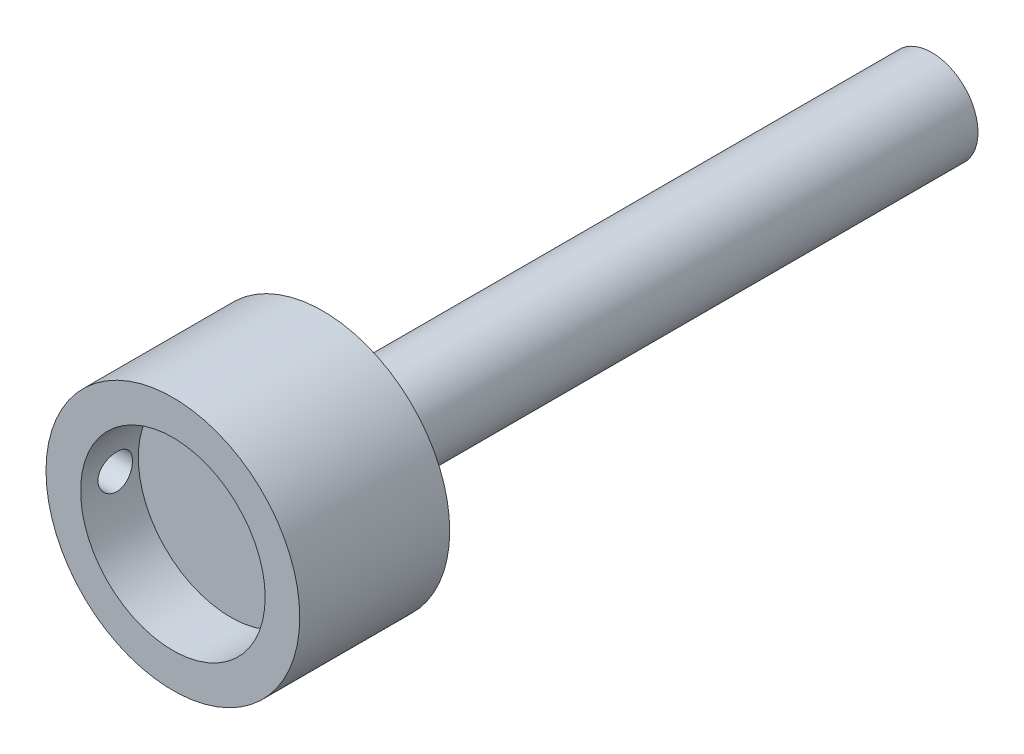
ISO-10303-21;
HEADER;
FILE_DESCRIPTION(('STEP AP214'),'2;1');
FILE_NAME('part.step','',(''),(''),'','','');
FILE_SCHEMA(('AUTOMOTIVE_DESIGN { 1 0 10303 214 1 1 1 1 }'));
ENDSEC;
DATA;
#1=APPLICATION_CONTEXT('core data for automotive mechanical design processes');
#2=APPLICATION_PROTOCOL_DEFINITION('international standard','automotive_design',2000,#1);
#3=PRODUCT_CONTEXT('',#1,'mechanical');
#4=PRODUCT('Part','Part','',(#3));
#5=PRODUCT_RELATED_PRODUCT_CATEGORY('part','',(#4));
#6=PRODUCT_DEFINITION_FORMATION('','',#4);
#7=PRODUCT_DEFINITION_CONTEXT('part definition',#1,'design');
#8=PRODUCT_DEFINITION('design','',#6,#7);
#9=PRODUCT_DEFINITION_SHAPE('','',#8);
#10=(LENGTH_UNIT() NAMED_UNIT(*) SI_UNIT(.MILLI.,.METRE.));
#11=(NAMED_UNIT(*) PLANE_ANGLE_UNIT() SI_UNIT($,.RADIAN.));
#12=(NAMED_UNIT(*) SI_UNIT($,.STERADIAN.) SOLID_ANGLE_UNIT());
#13=UNCERTAINTY_MEASURE_WITH_UNIT(LENGTH_MEASURE(1.E-05),#10,'distance_accuracy_value','');
#14=(GEOMETRIC_REPRESENTATION_CONTEXT(3) GLOBAL_UNCERTAINTY_ASSIGNED_CONTEXT((#13)) GLOBAL_UNIT_ASSIGNED_CONTEXT((#10,
#11,#12)) REPRESENTATION_CONTEXT('',''));
#15=CARTESIAN_POINT('',(0.,0.,0.));
#16=DIRECTION('',(0.,0.,1.));
#17=DIRECTION('',(1.,0.,0.));
#18=AXIS2_PLACEMENT_3D('',#15,#16,#17);
#19=CARTESIAN_POINT('',(0.,0.,13.));
#20=DIRECTION('',(0.,0.,-1.));
#21=DIRECTION('',(-1.,0.,0.));
#22=AXIS2_PLACEMENT_3D('',#19,#20,#21);
#23=CYLINDRICAL_SURFACE('',#22,11.);
#24=CARTESIAN_POINT('',(-11.,0.,11.5));
#25=CARTESIAN_POINT('',(-10.9999987467262,-0.0838384134298608,11.4999964805426));
#26=CARTESIAN_POINT('',(-10.9990314271488,-0.167727602289746,11.4929474073274));
#27=CARTESIAN_POINT('',(-10.9952656640845,-0.333167097641412,11.4649411167757));
#28=CARTESIAN_POINT('',(-10.992465364401,-0.414714945659857,11.4439698005502));
#29=CARTESIAN_POINT('',(-10.9853487739829,-0.573053093693594,11.3887522661594));
#30=CARTESIAN_POINT('',(-10.9810335583919,-0.649846722453227,11.3545154607979));
#31=CARTESIAN_POINT('',(-10.971365727223,-0.79658530244973,11.2737604754398));
#32=CARTESIAN_POINT('',(-10.9660132749006,-0.86653132885872,11.2272442277457));
#33=CARTESIAN_POINT('',(-10.9548285996925,-0.998057563812247,11.1229277857077));
#34=CARTESIAN_POINT('',(-10.9489937690522,-1.05958678462377,11.0650635769965));
#35=CARTESIAN_POINT('',(-10.9375227155932,-1.17209333908044,10.9398313892076));
#36=CARTESIAN_POINT('',(-10.9318865034525,-1.22307010612799,10.8724629001387));
#37=CARTESIAN_POINT('',(-10.9214253777188,-1.31321850524923,10.7297980617759));
#38=CARTESIAN_POINT('',(-10.916603830108,-1.35234166468404,10.6544708149948));
#39=CARTESIAN_POINT('',(-10.9083529406776,-1.41736264485278,10.4982381846263));
#40=CARTESIAN_POINT('',(-10.904923536173,-1.44326106107985,10.4173330523902));
#41=CARTESIAN_POINT('',(-10.8998704969217,-1.4809409055509,10.2527737564264));
#42=CARTESIAN_POINT('',(-10.8982357822449,-1.49280898864549,10.1691397807089));
#43=CARTESIAN_POINT('',(-10.8969234380482,-1.50235955059667,10.0010525269759));
#44=CARTESIAN_POINT('',(-10.8972457153308,-1.50004270497976,9.91659928816724));
#45=CARTESIAN_POINT('',(-10.8998008033656,-1.4813601701924,9.7498782743991));
#46=CARTESIAN_POINT('',(-10.9020205710196,-1.4650903891759,9.66759952363283));
#47=CARTESIAN_POINT('',(-10.9081001740818,-1.419113676953,9.50695095946735));
#48=CARTESIAN_POINT('',(-10.911960048455,-1.38940642650253,9.42858123898703));
#49=CARTESIAN_POINT('',(-10.920899582937,-1.31729641760208,9.27768007396237));
#50=CARTESIAN_POINT('',(-10.9259831927575,-1.27485243857761,9.20516857073198));
#51=CARTESIAN_POINT('',(-10.9367944433469,-1.1785032304482,9.06826085111422));
#52=CARTESIAN_POINT('',(-10.9425221191218,-1.12459737823042,9.00386507623326));
#53=CARTESIAN_POINT('',(-10.954033973898,-1.006325277838,8.88446044550542));
#54=CARTESIAN_POINT('',(-10.9598182294108,-0.941876450734229,8.82953335968757));
#55=CARTESIAN_POINT('',(-10.9707474705779,-0.80463094440541,8.73126350840162));
#56=CARTESIAN_POINT('',(-10.9758924542398,-0.73183423916464,8.68792077903695));
#57=CARTESIAN_POINT('',(-10.9849675408771,-0.57989296948045,8.61404813681996));
#58=CARTESIAN_POINT('',(-10.9888971094847,-0.500745632131289,8.58352385760728));
#59=CARTESIAN_POINT('',(-10.9950939520307,-0.338383087939894,8.5362221620544));
#60=CARTESIAN_POINT('',(-10.997361318692,-0.25516810828013,8.51944397890651));
#61=CARTESIAN_POINT('',(-10.9999661380375,-0.0877389073676727,8.50021791543442));
#62=CARTESIAN_POINT('',(-11.0003187469014,-0.0035378363878437,8.49765749141139));
#63=CARTESIAN_POINT('',(-10.9990953877098,0.164092294089254,8.50664187833073));
#64=CARTESIAN_POINT('',(-10.9975194687383,0.247521373180418,8.51818633028291));
#65=CARTESIAN_POINT('',(-10.9926255265792,0.410903378364946,8.55495922320966));
#66=CARTESIAN_POINT('',(-10.9893144012332,0.490868720620559,8.58013349557132));
#67=CARTESIAN_POINT('',(-10.9813204406364,0.645443141095587,8.64339475903291));
#68=CARTESIAN_POINT('',(-10.9766375509031,0.720052006425216,8.68148226301717));
#69=CARTESIAN_POINT('',(-10.9663836303603,0.86229489298246,8.76975753872403));
#70=CARTESIAN_POINT('',(-10.960807370571,0.929883728353245,8.82001750280037));
#71=CARTESIAN_POINT('',(-10.9494055314268,1.05570701325461,8.93110957795735));
#72=CARTESIAN_POINT('',(-10.9435799402192,1.11394101745332,8.99194219205667));
#73=CARTESIAN_POINT('',(-10.9322886877303,1.21980532954113,9.12295083300841));
#74=CARTESIAN_POINT('',(-10.9268257501214,1.26736066380642,9.19318771348107));
#75=CARTESIAN_POINT('',(-10.9169246504416,1.34999839549265,9.34071830769977));
#76=CARTESIAN_POINT('',(-10.9124864646235,1.38508108196142,9.41801185785858));
#77=CARTESIAN_POINT('',(-10.9051564726067,1.44165849505153,9.57722775667319));
#78=CARTESIAN_POINT('',(-10.902259998972,1.46319427050013,9.65913529443613));
#79=CARTESIAN_POINT('',(-10.8983284316023,1.49219810547519,9.82544652182803));
#80=CARTESIAN_POINT('',(-10.8972932333409,1.49966695497901,9.90985007101435));
#81=CARTESIAN_POINT('',(-10.8972048541528,1.50030856584718,10.078010975391));
#82=CARTESIAN_POINT('',(-10.8981353386205,1.49359914690637,10.1617678966084));
#83=CARTESIAN_POINT('',(-10.9018382005365,1.46632546438534,10.3269511386985));
#84=CARTESIAN_POINT('',(-10.9046105769335,1.44576120871189,10.4083774609012));
#85=CARTESIAN_POINT('',(-10.9116795081979,1.3914005645048,10.5665651393851));
#86=CARTESIAN_POINT('',(-10.9159752803929,1.35761096980691,10.6433288674825));
#87=CARTESIAN_POINT('',(-10.925608111245,1.2777703983912,10.7901162986064));
#88=CARTESIAN_POINT('',(-10.9309451926623,1.23171915365824,10.8601398542606));
#89=CARTESIAN_POINT('',(-10.9421122992185,1.12822915223083,10.9920600365998));
#90=CARTESIAN_POINT('',(-10.9479459056036,1.07070278423403,11.0538876362225));
#91=CARTESIAN_POINT('',(-10.9594178730356,0.946079868053623,11.1670553467108));
#92=CARTESIAN_POINT('',(-10.9650561880416,0.87898108195785,11.2183929983114));
#93=CARTESIAN_POINT('',(-10.9755309296992,0.736765493201999,11.3093259673834));
#94=CARTESIAN_POINT('',(-10.9803636164562,0.661613818517364,11.3488671582763));
#95=CARTESIAN_POINT('',(-10.9886453705716,0.505709693930316,11.414709481053));
#96=CARTESIAN_POINT('',(-10.9920959102772,0.424963312021878,11.4410247096937));
#97=CARTESIAN_POINT('',(-10.9964117606731,0.286518597087191,11.4735104370639));
#98=CARTESIAN_POINT('',(-10.9977506427886,0.229685788696074,11.4834293607973));
#99=CARTESIAN_POINT('',(-10.9995451890738,0.115243313646888,11.4966753209812));
#100=CARTESIAN_POINT('',(-11.0000008615472,0.0576336542977008,11.5000024194064));
#101=CARTESIAN_POINT('',(-11.,0.,11.5));
#102=B_SPLINE_CURVE_WITH_KNOTS('',3,(#24,#25,#26,#27,#28,#29,#30,#31,#32,#33,#34,#35,#36,#37,
#38,#39,#40,#41,#42,#43,#44,#45,#46,#47,#48,#49,#50,#51,#52,#53,#54,#55,#56,#57,#58,#59,#60,#61,
#62,#63,#64,#65,#66,#67,#68,#69,#70,#71,#72,#73,#74,#75,#76,#77,#78,#79,#80,#81,#82,#83,#84,#85,
#86,#87,#88,#89,#90,#91,#92,#93,#94,#95,#96,#97,#98,#99,#100,#101),.UNSPECIFIED.,.T.,.F.,(4,2,2,
2,2,2,2,2,2,2,2,2,2,2,2,2,2,2,2,2,2,2,2,2,2,2,2,2,2,2,2,2,2,2,2,2,2,2,4),(0.,0.251304688086151,
0.502864258429492,0.754245655375319,1.00558751830525,1.25839025869503,1.51120656941612,
1.76504317927172,2.01886835818389,2.27111752000617,2.52335466910191,2.77387178872724,
3.02439486038875,3.27573762185035,3.52709405079555,3.7805228474684,4.0339524339601,
4.28749328511462,4.54101999186671,4.79253696204825,5.04404753088009,5.29456578809544,
5.54509399649483,5.79714607697892,6.04921015271754,6.30299215129409,6.5567682682073,
6.80977166004953,7.06276084317861,7.31365598745061,7.56455098853993,7.81531727406242,
8.06608904128421,8.3188542354437,8.57167862009411,8.82564582024678,9.0793417549426,
9.25209960062624,9.42485582207675),.UNSPECIFIED.);
#103=CARTESIAN_POINT('',(-11.,0.,11.5));
#104=VERTEX_POINT('',#103);
#105=EDGE_CURVE('E57',#104,#104,#102,.T.);
#106=ORIENTED_EDGE('',*,*,#105,.T.);
#107=EDGE_LOOP('',(#106));
#108=FACE_BOUND('',#107,.T.);
#109=CARTESIAN_POINT('',(0.,0.,13.));
#110=DIRECTION('',(0.,0.,1.));
#111=DIRECTION('',(1.,0.,0.));
#112=AXIS2_PLACEMENT_3D('',#109,#110,#111);
#113=CIRCLE('',#112,11.);
#114=CARTESIAN_POINT('',(11.,0.,13.));
#115=VERTEX_POINT('',#114);
#116=EDGE_CURVE('E37',#115,#115,#113,.T.);
#117=ORIENTED_EDGE('',*,*,#116,.F.);
#118=EDGE_LOOP('',(#117));
#119=FACE_BOUND('',#118,.T.);
#120=CARTESIAN_POINT('',(0.,0.,0.));
#121=DIRECTION('',(0.,0.,1.));
#122=DIRECTION('',(1.,0.,0.));
#123=AXIS2_PLACEMENT_3D('',#120,#121,#122);
#124=CIRCLE('',#123,11.);
#125=CARTESIAN_POINT('',(11.,0.,0.));
#126=VERTEX_POINT('',#125);
#127=EDGE_CURVE('E41',#126,#126,#124,.T.);
#128=ORIENTED_EDGE('',*,*,#127,.T.);
#129=EDGE_LOOP('',(#128));
#130=FACE_BOUND('',#129,.T.);
#131=ADVANCED_FACE('F30',(#108,#119,#130),#23,.T.);
#132=CARTESIAN_POINT('',(0.,0.,13.));
#133=DIRECTION('',(0.,0.,1.));
#134=DIRECTION('',(1.,0.,0.));
#135=AXIS2_PLACEMENT_3D('',#132,#133,#134);
#136=PLANE('',#135);
#137=CARTESIAN_POINT('',(0.,0.,13.));
#138=DIRECTION('',(0.,0.,1.));
#139=DIRECTION('',(1.,0.,0.));
#140=AXIS2_PLACEMENT_3D('',#137,#138,#139);
#141=CIRCLE('',#140,8.);
#142=CARTESIAN_POINT('',(8.,0.,13.));
#143=VERTEX_POINT('',#142);
#144=EDGE_CURVE('E49',#143,#143,#141,.T.);
#145=ORIENTED_EDGE('',*,*,#144,.F.);
#146=EDGE_LOOP('',(#145));
#147=FACE_BOUND('',#146,.T.);
#148=ORIENTED_EDGE('',*,*,#116,.T.);
#149=EDGE_LOOP('',(#148));
#150=FACE_BOUND('',#149,.T.);
#151=ADVANCED_FACE('F84',(#147,#150),#136,.T.);
#152=CARTESIAN_POINT('',(0.,0.,0.));
#153=DIRECTION('',(0.,0.,1.));
#154=DIRECTION('',(1.,0.,0.));
#155=AXIS2_PLACEMENT_3D('',#152,#153,#154);
#156=PLANE('',#155);
#157=CARTESIAN_POINT('',(0.,0.,0.));
#158=DIRECTION('',(0.,0.,1.));
#159=DIRECTION('',(1.,0.,0.));
#160=AXIS2_PLACEMENT_3D('',#157,#158,#159);
#161=CIRCLE('',#160,4.);
#162=CARTESIAN_POINT('',(4.,0.,0.));
#163=VERTEX_POINT('',#162);
#164=EDGE_CURVE('E10',#163,#163,#161,.F.);
#165=ORIENTED_EDGE('',*,*,#164,.F.);
#166=EDGE_LOOP('',(#165));
#167=FACE_BOUND('',#166,.T.);
#168=ORIENTED_EDGE('',*,*,#127,.F.);
#169=EDGE_LOOP('',(#168));
#170=FACE_BOUND('',#169,.T.);
#171=ADVANCED_FACE('F86',(#167,#170),#156,.F.);
#172=CARTESIAN_POINT('',(0.,0.,8.));
#173=DIRECTION('',(0.,0.,1.));
#174=DIRECTION('',(1.,0.,0.));
#175=AXIS2_PLACEMENT_3D('',#172,#173,#174);
#176=CYLINDRICAL_SURFACE('',#175,8.);
#177=CARTESIAN_POINT('',(-8.,0.,8.5));
#178=CARTESIAN_POINT('',(-7.99999848833852,-0.0834717464654709,8.50000318958828));
#179=CARTESIAN_POINT('',(-7.99868009921714,-0.166984992730099,8.50699107661938));
#180=CARTESIAN_POINT('',(-7.9935478589052,-0.331658129841798,8.53473999511835));
#181=CARTESIAN_POINT('',(-7.98973190166897,-0.412815974152226,8.55551265063973));
#182=CARTESIAN_POINT('',(-7.98003138765458,-0.570372961851802,8.61017270125934));
#183=CARTESIAN_POINT('',(-7.97414869946483,-0.646776330685345,8.64404825245254));
#184=CARTESIAN_POINT('',(-7.96095710599783,-0.792807973094008,8.72391887692281));
#185=CARTESIAN_POINT('',(-7.9536483161829,-0.862436794477324,8.76991296914482));
#186=CARTESIAN_POINT('',(-7.93831336430504,-0.993783715930504,8.87329976800367));
#187=CARTESIAN_POINT('',(-7.93028034856351,-1.05540895503183,8.93080944467014));
#188=CARTESIAN_POINT('',(-7.9144531845865,-1.16819606135369,9.05534330908756));
#189=CARTESIAN_POINT('',(-7.90665905354527,-1.21935717689242,9.12236817976929));
#190=CARTESIAN_POINT('',(-7.89212551245005,-1.31014998665793,9.26468608836397));
#191=CARTESIAN_POINT('',(-7.88539493886182,-1.34968721969605,9.34004037031724));
#192=CARTESIAN_POINT('',(-7.87384713211987,-1.41550524332283,9.49646891517679));
#193=CARTESIAN_POINT('',(-7.86902973396962,-1.44178717713098,9.57754268411122));
#194=CARTESIAN_POINT('',(-7.8619226957455,-1.480050535035,9.74211523091441));
#195=CARTESIAN_POINT('',(-7.85960445366405,-1.49219390192039,9.82557509720347));
#196=CARTESIAN_POINT('',(-7.85767197152761,-1.50233808095347,9.99337738480825));
#197=CARTESIAN_POINT('',(-7.8580574889876,-1.50034016135374,10.0777197263023));
#198=CARTESIAN_POINT('',(-7.86146292701753,-1.48238979602363,10.243719525266));
#199=CARTESIAN_POINT('',(-7.86444808147334,-1.46662149996045,10.3253977143002));
#200=CARTESIAN_POINT('',(-7.87266183284666,-1.42186799396207,10.4849284197826));
#201=CARTESIAN_POINT('',(-7.87789052509516,-1.392882222395,10.5627807735093));
#202=CARTESIAN_POINT('',(-7.89003855292588,-1.322336471793,10.7129886790003));
#203=CARTESIAN_POINT('',(-7.89696783823366,-1.28070213532456,10.7853084705808));
#204=CARTESIAN_POINT('',(-7.91172971602918,-1.18609368930416,10.9220047285402));
#205=CARTESIAN_POINT('',(-7.91956240015522,-1.13311842889266,10.9863803877148));
#206=CARTESIAN_POINT('',(-7.93540001272164,-1.01633905685298,11.1064249556725));
#207=CARTESIAN_POINT('',(-7.94340571024031,-0.952377436860684,11.1619406524517));
#208=CARTESIAN_POINT('',(-7.95857386108318,-0.815968037098827,11.2614772406754));
#209=CARTESIAN_POINT('',(-7.96573630595245,-0.74352017225577,11.3054980168704));
#210=CARTESIAN_POINT('',(-7.97842539677509,-0.592034988874669,11.38081775387));
#211=CARTESIAN_POINT('',(-7.98394999136289,-0.512989564446494,11.4121007791179));
#212=CARTESIAN_POINT('',(-7.99272505402719,-0.350639115398697,11.4609020930922));
#213=CARTESIAN_POINT('',(-7.99597576367994,-0.267334544277788,11.4784218440454));
#214=CARTESIAN_POINT('',(-7.99980360641981,-0.100148652903386,11.4989860310183));
#215=CARTESIAN_POINT('',(-8.00041950912279,-0.0162940126341361,11.5022403915297));
#216=CARTESIAN_POINT('',(-7.99901543598228,0.150761248092183,11.4947445204524));
#217=CARTESIAN_POINT('',(-7.99699558964431,0.233961900480385,11.4839949769347));
#218=CARTESIAN_POINT('',(-7.99057111500406,0.396681573218216,11.4489709648166));
#219=CARTESIAN_POINT('',(-7.98618522374031,0.476224261046063,11.4248027174622));
#220=CARTESIAN_POINT('',(-7.97551842212498,0.630128631824633,11.3637422932212));
#221=CARTESIAN_POINT('',(-7.96923738311334,0.704489962595103,11.3268492524342));
#222=CARTESIAN_POINT('',(-7.95538030357666,0.846816671513214,11.2409218718405));
#223=CARTESIAN_POINT('',(-7.94779086174563,0.914703277015121,11.1917592614632));
#224=CARTESIAN_POINT('',(-7.93219343489711,1.04133832326455,11.0828618626376));
#225=CARTESIAN_POINT('',(-7.92418541084687,1.10008590976087,11.0231260869987));
#226=CARTESIAN_POINT('',(-7.9085247569745,1.20757295872048,10.8938276810886));
#227=CARTESIAN_POINT('',(-7.90087825860257,1.25616916218577,10.8241450918746));
#228=CARTESIAN_POINT('',(-7.88692985578532,1.34096675057787,10.6774823754763));
#229=CARTESIAN_POINT('',(-7.8806279013735,1.37716859613924,10.6005025196295));
#230=CARTESIAN_POINT('',(-7.87013024209574,1.43594673512823,10.4417941327575));
#231=CARTESIAN_POINT('',(-7.86592440436878,1.45858868794786,10.3600906204407));
#232=CARTESIAN_POINT('',(-7.86007203802415,1.48980679326236,10.1939527774786));
#233=CARTESIAN_POINT('',(-7.8584252206579,1.49838453270708,10.1095187560296));
#234=CARTESIAN_POINT('',(-7.85789199803857,1.50117762148355,9.94175166855849));
#235=CARTESIAN_POINT('',(-7.85896215974293,1.49561895003499,9.85842241904301));
#236=CARTESIAN_POINT('',(-7.86364600659998,1.47079175378803,9.69390857795471));
#237=CARTESIAN_POINT('',(-7.86725967655747,1.45152331089332,9.61272397357256));
#238=CARTESIAN_POINT('',(-7.8766050802318,1.39991887583263,9.45492551520452));
#239=CARTESIAN_POINT('',(-7.88233284594965,1.36760735397253,9.37830340865423));
#240=CARTESIAN_POINT('',(-7.8952638755184,1.29085868912205,9.23153174575916));
#241=CARTESIAN_POINT('',(-7.90246724360119,1.24642068948186,9.16138264715522));
#242=CARTESIAN_POINT('',(-7.91767266107745,1.14589487339535,9.0284163199577));
#243=CARTESIAN_POINT('',(-7.92568505353043,1.08964259864304,8.9657245874329));
#244=CARTESIAN_POINT('',(-7.94152833918735,0.967427926742293,8.85059483753548));
#245=CARTESIAN_POINT('',(-7.94935919027328,0.901463301891617,8.79815917901986));
#246=CARTESIAN_POINT('',(-7.96403975968049,0.760984945071874,8.70458904737294));
#247=CARTESIAN_POINT('',(-7.97088000990561,0.686399590640517,8.66356057150936));
#248=CARTESIAN_POINT('',(-7.98271619380687,0.531290113653834,8.59468236339486));
#249=CARTESIAN_POINT('',(-7.98771385879037,0.450771651705248,8.56682025295309));
#250=CARTESIAN_POINT('',(-7.99428290707632,0.308347202825154,8.53072268558132));
#251=CARTESIAN_POINT('',(-7.99641470878206,0.247273810251871,8.5192213696872));
#252=CARTESIAN_POINT('',(-7.9992737995401,0.124141247115158,8.50385893788355));
#253=CARTESIAN_POINT('',(-8.00000112429805,0.0620821016527094,8.49999762774409));
#254=CARTESIAN_POINT('',(-8.,0.,8.5));
#255=B_SPLINE_CURVE_WITH_KNOTS('',3,(#177,#178,#179,#180,#181,#182,#183,#184,#185,#186,#187,
#188,#189,#190,#191,#192,#193,#194,#195,#196,#197,#198,#199,#200,#201,#202,#203,#204,#205,#206,
#207,#208,#209,#210,#211,#212,#213,#214,#215,#216,#217,#218,#219,#220,#221,#222,#223,#224,#225,
#226,#227,#228,#229,#230,#231,#232,#233,#234,#235,#236,#237,#238,#239,#240,#241,#242,#243,#244,
#245,#246,#247,#248,#249,#250,#251,#252,#253,#254),.UNSPECIFIED.,.T.,.F.,(4,2,2,2,2,2,2,2,2,2,2,
2,2,2,2,2,2,2,2,2,2,2,2,2,2,2,2,2,2,2,2,2,2,2,2,2,2,2,4),(0.,0.250188200964924,
0.500587642535453,0.750761271230908,1.00091465336891,1.25375118013631,1.50660586283617,
1.76146190504358,2.01629596311949,2.26818151445336,2.52004447587256,2.76859000612766,
3.01714609846787,3.26719262629531,3.5172645404986,3.77127768464077,4.02529337544948,
4.27962588321699,4.53393136673746,4.78448174076097,5.03501980464584,5.28360233907829,
5.53220175338032,5.78351778017709,6.03485728413099,6.28953436987299,6.54420198954946,
6.7976262781856,7.05102196946513,7.30039252231749,7.54976158541507,7.79866496207693,
8.04758592655424,8.30023369966381,8.55293951262257,8.80792048916316,9.06266126931174,
9.24874344524411,9.43482089039542),.UNSPECIFIED.);
#256=CARTESIAN_POINT('',(-8.,0.,8.5));
#257=VERTEX_POINT('',#256);
#258=EDGE_CURVE('E51',#257,#257,#255,.T.);
#259=ORIENTED_EDGE('',*,*,#258,.T.);
#260=EDGE_LOOP('',(#259));
#261=FACE_BOUND('',#260,.T.);
#262=CARTESIAN_POINT('',(0.,0.,8.));
#263=DIRECTION('',(0.,0.,1.));
#264=DIRECTION('',(1.,0.,0.));
#265=AXIS2_PLACEMENT_3D('',#262,#263,#264);
#266=CIRCLE('',#265,8.);
#267=CARTESIAN_POINT('',(8.,0.,8.));
#268=VERTEX_POINT('',#267);
#269=EDGE_CURVE('E46',#268,#268,#266,.T.);
#270=ORIENTED_EDGE('',*,*,#269,.F.);
#271=EDGE_LOOP('',(#270));
#272=FACE_BOUND('',#271,.T.);
#273=ORIENTED_EDGE('',*,*,#144,.T.);
#274=EDGE_LOOP('',(#273));
#275=FACE_BOUND('',#274,.T.);
#276=ADVANCED_FACE('F59',(#261,#272,#275),#176,.F.);
#277=CARTESIAN_POINT('',(0.,0.,8.));
#278=DIRECTION('',(0.,0.,1.));
#279=DIRECTION('',(1.,0.,0.));
#280=AXIS2_PLACEMENT_3D('',#277,#278,#279);
#281=PLANE('',#280);
#282=ORIENTED_EDGE('',*,*,#269,.T.);
#283=EDGE_LOOP('',(#282));
#284=FACE_BOUND('',#283,.T.);
#285=ADVANCED_FACE('F68',(#284),#281,.T.);
#286=CARTESIAN_POINT('',(-15.,0.,10.));
#287=DIRECTION('',(1.,0.,0.));
#288=DIRECTION('',(0.,0.,-1.));
#289=AXIS2_PLACEMENT_3D('',#286,#287,#288);
#290=CYLINDRICAL_SURFACE('',#289,1.5);
#291=ORIENTED_EDGE('',*,*,#258,.F.);
#292=EDGE_LOOP('',(#291));
#293=FACE_BOUND('',#292,.T.);
#294=ORIENTED_EDGE('',*,*,#105,.F.);
#295=EDGE_LOOP('',(#294));
#296=FACE_BOUND('',#295,.T.);
#297=ADVANCED_FACE('F63',(#293,#296),#290,.F.);
#298=CARTESIAN_POINT('',(0.,0.,-52.8));
#299=DIRECTION('',(0.,0.,1.));
#300=DIRECTION('',(1.,0.,0.));
#301=AXIS2_PLACEMENT_3D('',#298,#299,#300);
#302=CYLINDRICAL_SURFACE('',#301,4.);
#303=CARTESIAN_POINT('',(0.,0.,-52.8));
#304=DIRECTION('',(0.,0.,-1.));
#305=DIRECTION('',(-1.,0.,0.));
#306=AXIS2_PLACEMENT_3D('',#303,#304,#305);
#307=CIRCLE('',#306,4.);
#308=CARTESIAN_POINT('',(-4.,0.,-52.8));
#309=VERTEX_POINT('',#308);
#310=EDGE_CURVE('E58',#309,#309,#307,.T.);
#311=ORIENTED_EDGE('',*,*,#310,.F.);
#312=EDGE_LOOP('',(#311));
#313=FACE_BOUND('',#312,.T.);
#314=ORIENTED_EDGE('',*,*,#164,.T.);
#315=EDGE_LOOP('',(#314));
#316=FACE_BOUND('',#315,.T.);
#317=ADVANCED_FACE('F67',(#313,#316),#302,.T.);
#318=CARTESIAN_POINT('',(0.,0.,-52.8));
#319=DIRECTION('',(0.,0.,-1.));
#320=DIRECTION('',(-1.,0.,0.));
#321=AXIS2_PLACEMENT_3D('',#318,#319,#320);
#322=PLANE('',#321);
#323=ORIENTED_EDGE('',*,*,#310,.T.);
#324=EDGE_LOOP('',(#323));
#325=FACE_BOUND('',#324,.T.);
#326=ADVANCED_FACE('F135',(#325),#322,.T.);
#327=CLOSED_SHELL('',(#131,#151,#171,#276,#285,#297,#317,#326));
#328=MANIFOLD_SOLID_BREP('B2',#327);
#329=ADVANCED_BREP_SHAPE_REPRESENTATION('',(#18,#328),#14);
#330=SHAPE_DEFINITION_REPRESENTATION(#9,#329);
ENDSEC;
END-ISO-10303-21;
